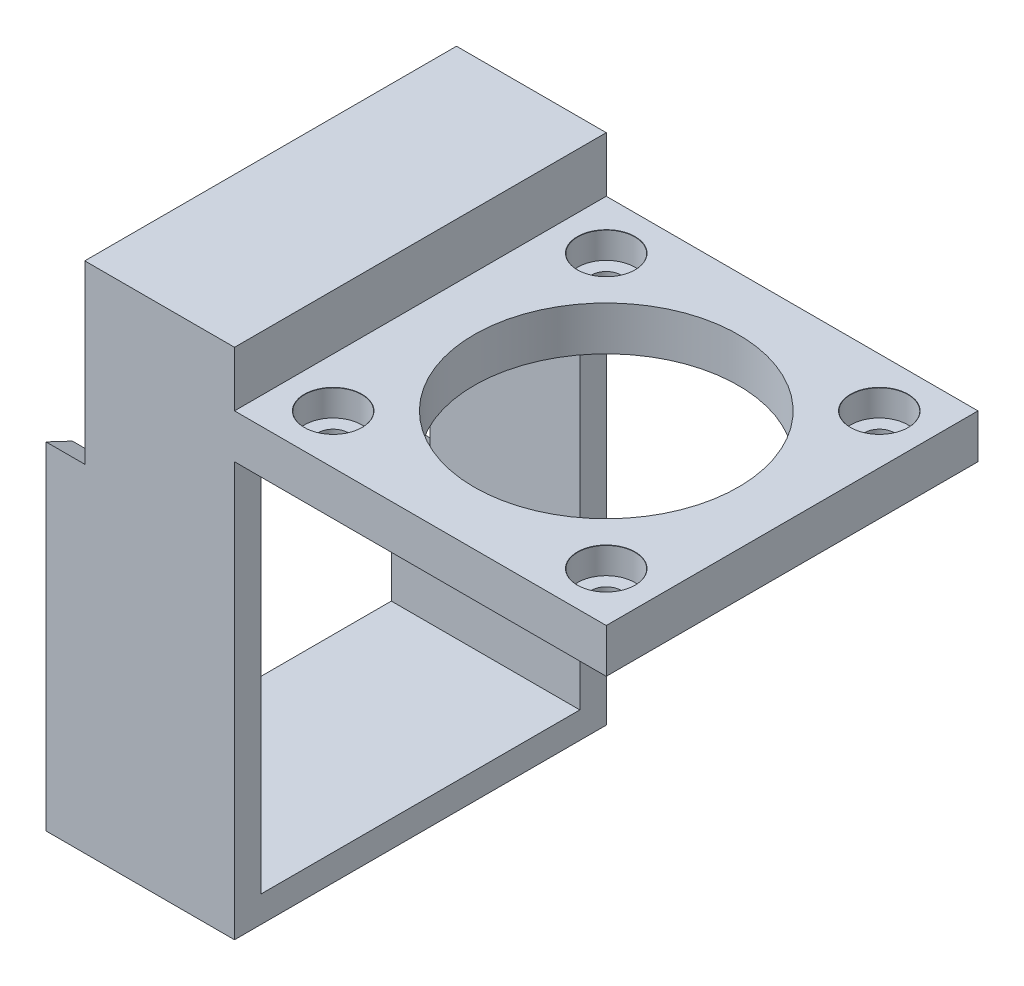
ISO-10303-21;
HEADER;
FILE_DESCRIPTION(('STEP AP214'),'2;1');
FILE_NAME('part.step','',(''),(''),'','','');
FILE_SCHEMA(('AUTOMOTIVE_DESIGN { 1 0 10303 214 1 1 1 1 }'));
ENDSEC;
DATA;
#1=APPLICATION_CONTEXT('core data for automotive mechanical design processes');
#2=APPLICATION_PROTOCOL_DEFINITION('international standard','automotive_design',2000,#1);
#3=PRODUCT_CONTEXT('',#1,'mechanical');
#4=PRODUCT('Part','Part','',(#3));
#5=PRODUCT_RELATED_PRODUCT_CATEGORY('part','',(#4));
#6=PRODUCT_DEFINITION_FORMATION('','',#4);
#7=PRODUCT_DEFINITION_CONTEXT('part definition',#1,'design');
#8=PRODUCT_DEFINITION('design','',#6,#7);
#9=PRODUCT_DEFINITION_SHAPE('','',#8);
#10=(LENGTH_UNIT() NAMED_UNIT(*) SI_UNIT(.MILLI.,.METRE.));
#11=(NAMED_UNIT(*) PLANE_ANGLE_UNIT() SI_UNIT($,.RADIAN.));
#12=(NAMED_UNIT(*) SI_UNIT($,.STERADIAN.) SOLID_ANGLE_UNIT());
#13=UNCERTAINTY_MEASURE_WITH_UNIT(LENGTH_MEASURE(1.E-05),#10,'distance_accuracy_value','');
#14=(GEOMETRIC_REPRESENTATION_CONTEXT(3) GLOBAL_UNCERTAINTY_ASSIGNED_CONTEXT((#13)) GLOBAL_UNIT_ASSIGNED_CONTEXT((#10,
#11,#12)) REPRESENTATION_CONTEXT('',''));
#15=CARTESIAN_POINT('',(0.,0.,0.));
#16=DIRECTION('',(0.,0.,1.));
#17=DIRECTION('',(1.,0.,0.));
#18=AXIS2_PLACEMENT_3D('',#15,#16,#17);
#19=CARTESIAN_POINT('',(-4.4,38.25,21.1));
#20=DIRECTION('',(0.,0.903650615755439,-0.428270434007317));
#21=DIRECTION('',(0.,0.428270434007317,0.903650615755439));
#22=AXIS2_PLACEMENT_3D('',#19,#20,#21);
#23=PLANE('',#22);
#24=DIRECTION('',(1.,0.,0.));
#25=VECTOR('',#24,1.);
#26=CARTESIAN_POINT('',(-4.4,36.8281990521327,18.1));
#27=LINE('',#26,#25);
#28=CARTESIAN_POINT('',(-4.4,36.8281990521327,18.1));
#29=VERTEX_POINT('',#28);
#30=CARTESIAN_POINT('',(0.,36.8281990521327,18.1));
#31=VERTEX_POINT('',#30);
#32=EDGE_CURVE('E450',#29,#31,#27,.T.);
#33=ORIENTED_EDGE('',*,*,#32,.F.);
#34=DIRECTION('',(0.,0.428270434007317,0.903650615755439));
#35=VECTOR('',#34,1.);
#36=CARTESIAN_POINT('',(-4.4,38.25,21.1));
#37=LINE('',#36,#35);
#38=CARTESIAN_POINT('',(-4.4,38.25,21.1));
#39=VERTEX_POINT('',#38);
#40=EDGE_CURVE('E176',#29,#39,#37,.T.);
#41=ORIENTED_EDGE('',*,*,#40,.T.);
#42=DIRECTION('',(1.,0.,0.));
#43=VECTOR('',#42,1.);
#44=CARTESIAN_POINT('',(-4.4,38.25,21.1));
#45=LINE('',#44,#43);
#46=CARTESIAN_POINT('',(0.,38.25,21.1));
#47=VERTEX_POINT('',#46);
#48=EDGE_CURVE('E201',#39,#47,#45,.T.);
#49=ORIENTED_EDGE('',*,*,#48,.T.);
#50=DIRECTION('',(0.,0.428270434007317,0.903650615755439));
#51=VECTOR('',#50,1.);
#52=CARTESIAN_POINT('',(0.,38.25,21.1));
#53=LINE('',#52,#51);
#54=EDGE_CURVE('E200',#31,#47,#53,.T.);
#55=ORIENTED_EDGE('',*,*,#54,.F.);
#56=EDGE_LOOP('',(#33,#41,#49,#55));
#57=FACE_BOUND('',#56,.T.);
#58=ADVANCED_FACE('F45',(#57),#23,.T.);
#59=CARTESIAN_POINT('',(17.,47.,-17.101));
#60=DIRECTION('',(1.,0.,0.));
#61=DIRECTION('',(0.,0.,-1.));
#62=AXIS2_PLACEMENT_3D('',#59,#60,#61);
#63=PLANE('',#62);
#64=DIRECTION('',(0.,0.,1.));
#65=VECTOR('',#64,1.);
#66=CARTESIAN_POINT('',(17.,52.,21.1));
#67=LINE('',#66,#65);
#68=CARTESIAN_POINT('',(17.,52.,-21.1));
#69=VERTEX_POINT('',#68);
#70=CARTESIAN_POINT('',(17.,52.,21.1));
#71=VERTEX_POINT('',#70);
#72=EDGE_CURVE('E297',#69,#71,#67,.T.);
#73=ORIENTED_EDGE('',*,*,#72,.F.);
#74=DIRECTION('',(0.,1.,0.));
#75=VECTOR('',#74,1.);
#76=CARTESIAN_POINT('',(17.,58.25,-21.1));
#77=LINE('',#76,#75);
#78=CARTESIAN_POINT('',(17.,58.25,-21.1));
#79=VERTEX_POINT('',#78);
#80=EDGE_CURVE('E337',#69,#79,#77,.T.);
#81=ORIENTED_EDGE('',*,*,#80,.T.);
#82=DIRECTION('',(0.,0.,1.));
#83=VECTOR('',#82,1.);
#84=CARTESIAN_POINT('',(17.,58.25,21.1));
#85=LINE('',#84,#83);
#86=CARTESIAN_POINT('',(17.,58.25,21.1));
#87=VERTEX_POINT('',#86);
#88=EDGE_CURVE('E324',#79,#87,#85,.T.);
#89=ORIENTED_EDGE('',*,*,#88,.T.);
#90=DIRECTION('',(0.,-1.,0.));
#91=VECTOR('',#90,1.);
#92=CARTESIAN_POINT('',(17.,58.25,21.1));
#93=LINE('',#92,#91);
#94=EDGE_CURVE('E342',#87,#71,#93,.T.);
#95=ORIENTED_EDGE('',*,*,#94,.T.);
#96=EDGE_LOOP('',(#73,#81,#89,#95));
#97=FACE_BOUND('',#96,.T.);
#98=ADVANCED_FACE('F394',(#97),#63,.T.);
#99=CARTESIAN_POINT('',(88.9298442928942,58.25,21.1));
#100=DIRECTION('',(0.,0.,-1.));
#101=DIRECTION('',(0.,1.,0.));
#102=AXIS2_PLACEMENT_3D('',#99,#100,#101);
#103=PLANE('',#102);
#104=ORIENTED_EDGE('',*,*,#94,.F.);
#105=DIRECTION('',(-1.,0.,0.));
#106=VECTOR('',#105,1.);
#107=CARTESIAN_POINT('',(88.9298442928942,58.25,21.1));
#108=LINE('',#107,#106);
#109=CARTESIAN_POINT('',(0.,58.25,21.1));
#110=VERTEX_POINT('',#109);
#111=EDGE_CURVE('E292',#87,#110,#108,.T.);
#112=ORIENTED_EDGE('',*,*,#111,.T.);
#113=DIRECTION('',(0.,-1.,0.));
#114=VECTOR('',#113,1.);
#115=CARTESIAN_POINT('',(0.,58.25,21.1));
#116=LINE('',#115,#114);
#117=EDGE_CURVE('E330',#110,#47,#116,.T.);
#118=ORIENTED_EDGE('',*,*,#117,.T.);
#119=ORIENTED_EDGE('',*,*,#48,.F.);
#120=DIRECTION('',(0.,-1.,0.));
#121=VECTOR('',#120,1.);
#122=CARTESIAN_POINT('',(-4.4,0.,21.1));
#123=LINE('',#122,#121);
#124=CARTESIAN_POINT('',(-4.4,0.,21.1));
#125=VERTEX_POINT('',#124);
#126=EDGE_CURVE('E179',#39,#125,#123,.T.);
#127=ORIENTED_EDGE('',*,*,#126,.T.);
#128=DIRECTION('',(-1.,0.,0.));
#129=VECTOR('',#128,1.);
#130=CARTESIAN_POINT('',(88.9298442928942,0.,21.1));
#131=LINE('',#130,#129);
#132=CARTESIAN_POINT('',(17.,0.,21.1));
#133=VERTEX_POINT('',#132);
#134=EDGE_CURVE('E334',#133,#125,#131,.T.);
#135=ORIENTED_EDGE('',*,*,#134,.F.);
#136=CARTESIAN_POINT('',(17.,47.,21.1));
#137=VERTEX_POINT('',#136);
#138=EDGE_CURVE('E345',#137,#133,#93,.T.);
#139=ORIENTED_EDGE('',*,*,#138,.F.);
#140=DIRECTION('',(-1.,0.,0.));
#141=VECTOR('',#140,1.);
#142=CARTESIAN_POINT('',(101.695176196834,47.,21.1));
#143=LINE('',#142,#141);
#144=CARTESIAN_POINT('',(59.2,47.,21.1));
#145=VERTEX_POINT('',#144);
#146=EDGE_CURVE('E313',#145,#137,#143,.T.);
#147=ORIENTED_EDGE('',*,*,#146,.F.);
#148=DIRECTION('',(0.,1.,0.));
#149=VECTOR('',#148,1.);
#150=CARTESIAN_POINT('',(59.2,52.,21.1));
#151=LINE('',#150,#149);
#152=CARTESIAN_POINT('',(59.2,52.,21.1));
#153=VERTEX_POINT('',#152);
#154=EDGE_CURVE('E288',#145,#153,#151,.T.);
#155=ORIENTED_EDGE('',*,*,#154,.T.);
#156=DIRECTION('',(-1.,0.,0.));
#157=VECTOR('',#156,1.);
#158=CARTESIAN_POINT('',(101.695176196834,52.,21.1));
#159=LINE('',#158,#157);
#160=EDGE_CURVE('E301',#153,#71,#159,.T.);
#161=ORIENTED_EDGE('',*,*,#160,.T.);
#162=EDGE_LOOP('',(#104,#112,#118,#119,#127,#135,#139,#147,#155,#161));
#163=FACE_BOUND('',#162,.T.);
#164=ADVANCED_FACE('F400',(#163),#103,.F.);
#165=CARTESIAN_POINT('',(88.9298442928942,0.,21.1));
#166=DIRECTION('',(0.,1.,0.));
#167=DIRECTION('',(0.,0.,1.));
#168=AXIS2_PLACEMENT_3D('',#165,#166,#167);
#169=PLANE('',#168);
#170=DIRECTION('',(0.,0.,-1.));
#171=VECTOR('',#170,1.);
#172=CARTESIAN_POINT('',(17.,0.,21.1));
#173=LINE('',#172,#171);
#174=CARTESIAN_POINT('',(17.,0.,-21.1));
#175=VERTEX_POINT('',#174);
#176=EDGE_CURVE('E338',#133,#175,#173,.T.);
#177=ORIENTED_EDGE('',*,*,#176,.F.);
#178=ORIENTED_EDGE('',*,*,#134,.T.);
#179=DIRECTION('',(0.,0.,-1.));
#180=VECTOR('',#179,1.);
#181=CARTESIAN_POINT('',(-4.4,0.,-21.1));
#182=LINE('',#181,#180);
#183=CARTESIAN_POINT('',(-4.4,0.,-21.1));
#184=VERTEX_POINT('',#183);
#185=EDGE_CURVE('E192',#125,#184,#182,.T.);
#186=ORIENTED_EDGE('',*,*,#185,.T.);
#187=DIRECTION('',(-1.,0.,0.));
#188=VECTOR('',#187,1.);
#189=CARTESIAN_POINT('',(88.9298442928942,0.,-21.1));
#190=LINE('',#189,#188);
#191=EDGE_CURVE('E329',#175,#184,#190,.T.);
#192=ORIENTED_EDGE('',*,*,#191,.F.);
#193=EDGE_LOOP('',(#177,#178,#186,#192));
#194=FACE_BOUND('',#193,.T.);
#195=ADVANCED_FACE('F465',(#194),#169,.F.);
#196=CARTESIAN_POINT('',(88.9298442928942,58.25,-21.1));
#197=DIRECTION('',(0.,0.,1.));
#198=DIRECTION('',(0.,-1.,0.));
#199=AXIS2_PLACEMENT_3D('',#196,#197,#198);
#200=PLANE('',#199);
#201=CARTESIAN_POINT('',(17.,47.,-21.1));
#202=VERTEX_POINT('',#201);
#203=EDGE_CURVE('E54',#175,#202,#77,.T.);
#204=ORIENTED_EDGE('',*,*,#203,.F.);
#205=ORIENTED_EDGE('',*,*,#191,.T.);
#206=DIRECTION('',(0.,1.,0.));
#207=VECTOR('',#206,1.);
#208=CARTESIAN_POINT('',(-4.4,18.25,-21.1));
#209=LINE('',#208,#207);
#210=CARTESIAN_POINT('',(-4.4,18.25,-21.1));
#211=VERTEX_POINT('',#210);
#212=EDGE_CURVE('E185',#184,#211,#209,.T.);
#213=ORIENTED_EDGE('',*,*,#212,.T.);
#214=DIRECTION('',(1.,0.,0.));
#215=VECTOR('',#214,1.);
#216=CARTESIAN_POINT('',(-4.4,18.25,-21.1));
#217=LINE('',#216,#215);
#218=CARTESIAN_POINT('',(0.,18.25,-21.1));
#219=VERTEX_POINT('',#218);
#220=EDGE_CURVE('E190',#211,#219,#217,.T.);
#221=ORIENTED_EDGE('',*,*,#220,.T.);
#222=DIRECTION('',(0.,1.,0.));
#223=VECTOR('',#222,1.);
#224=CARTESIAN_POINT('',(0.,58.25,-21.1));
#225=LINE('',#224,#223);
#226=CARTESIAN_POINT('',(0.,58.25,-21.1));
#227=VERTEX_POINT('',#226);
#228=EDGE_CURVE('E326',#219,#227,#225,.T.);
#229=ORIENTED_EDGE('',*,*,#228,.T.);
#230=DIRECTION('',(-1.,0.,0.));
#231=VECTOR('',#230,1.);
#232=CARTESIAN_POINT('',(88.9298442928942,58.25,-21.1));
#233=LINE('',#232,#231);
#234=EDGE_CURVE('E325',#79,#227,#233,.T.);
#235=ORIENTED_EDGE('',*,*,#234,.F.);
#236=ORIENTED_EDGE('',*,*,#80,.F.);
#237=DIRECTION('',(-1.,0.,0.));
#238=VECTOR('',#237,1.);
#239=CARTESIAN_POINT('',(101.695176196834,52.,-21.1));
#240=LINE('',#239,#238);
#241=CARTESIAN_POINT('',(59.2,52.,-21.1));
#242=VERTEX_POINT('',#241);
#243=EDGE_CURVE('E305',#242,#69,#240,.T.);
#244=ORIENTED_EDGE('',*,*,#243,.F.);
#245=DIRECTION('',(0.,-1.,0.));
#246=VECTOR('',#245,1.);
#247=CARTESIAN_POINT('',(59.2,52.,-21.1));
#248=LINE('',#247,#246);
#249=CARTESIAN_POINT('',(59.2,47.,-21.1));
#250=VERTEX_POINT('',#249);
#251=EDGE_CURVE('E279',#242,#250,#248,.T.);
#252=ORIENTED_EDGE('',*,*,#251,.T.);
#253=DIRECTION('',(-1.,0.,0.));
#254=VECTOR('',#253,1.);
#255=CARTESIAN_POINT('',(101.695176196834,47.,-21.1));
#256=LINE('',#255,#254);
#257=EDGE_CURVE('E309',#250,#202,#256,.T.);
#258=ORIENTED_EDGE('',*,*,#257,.T.);
#259=EDGE_LOOP('',(#204,#205,#213,#221,#229,#235,#236,#244,#252,#258));
#260=FACE_BOUND('',#259,.T.);
#261=ADVANCED_FACE('F485',(#260),#200,.F.);
#262=CARTESIAN_POINT('',(88.9298442928942,58.25,21.1));
#263=DIRECTION('',(0.,-1.,0.));
#264=DIRECTION('',(0.,0.,-1.));
#265=AXIS2_PLACEMENT_3D('',#262,#263,#264);
#266=PLANE('',#265);
#267=ORIENTED_EDGE('',*,*,#88,.F.);
#268=ORIENTED_EDGE('',*,*,#234,.T.);
#269=DIRECTION('',(0.,0.,1.));
#270=VECTOR('',#269,1.);
#271=CARTESIAN_POINT('',(0.,58.25,21.1));
#272=LINE('',#271,#270);
#273=EDGE_CURVE('E320',#227,#110,#272,.T.);
#274=ORIENTED_EDGE('',*,*,#273,.T.);
#275=ORIENTED_EDGE('',*,*,#111,.F.);
#276=EDGE_LOOP('',(#267,#268,#274,#275));
#277=FACE_BOUND('',#276,.T.);
#278=ADVANCED_FACE('F496',(#277),#266,.F.);
#279=CARTESIAN_POINT('',(0.,0.,0.));
#280=DIRECTION('',(1.,0.,0.));
#281=DIRECTION('',(0.,0.,-1.));
#282=AXIS2_PLACEMENT_3D('',#279,#280,#281);
#283=PLANE('',#282);
#284=DIRECTION('',(0.,0.,1.));
#285=VECTOR('',#284,1.);
#286=CARTESIAN_POINT('',(0.,44.25,0.));
#287=LINE('',#286,#285);
#288=CARTESIAN_POINT('',(0.,44.25,-18.1));
#289=VERTEX_POINT('',#288);
#290=CARTESIAN_POINT('',(0.,44.25,18.1));
#291=VERTEX_POINT('',#290);
#292=EDGE_CURVE('E424',#289,#291,#287,.T.);
#293=ORIENTED_EDGE('',*,*,#292,.T.);
#294=DIRECTION('',(0.,-1.,0.));
#295=VECTOR('',#294,1.);
#296=CARTESIAN_POINT('',(0.,0.,18.1));
#297=LINE('',#296,#295);
#298=EDGE_CURVE('E453',#291,#31,#297,.T.);
#299=ORIENTED_EDGE('',*,*,#298,.T.);
#300=ORIENTED_EDGE('',*,*,#54,.T.);
#301=ORIENTED_EDGE('',*,*,#117,.F.);
#302=ORIENTED_EDGE('',*,*,#273,.F.);
#303=ORIENTED_EDGE('',*,*,#228,.F.);
#304=CARTESIAN_POINT('',(0.,19.6718009478673,-18.1));
#305=VERTEX_POINT('',#304);
#306=EDGE_CURVE('E196',#219,#305,#53,.T.);
#307=ORIENTED_EDGE('',*,*,#306,.T.);
#308=DIRECTION('',(0.,1.,0.));
#309=VECTOR('',#308,1.);
#310=CARTESIAN_POINT('',(0.,0.,-18.1));
#311=LINE('',#310,#309);
#312=EDGE_CURVE('E447',#305,#289,#311,.T.);
#313=ORIENTED_EDGE('',*,*,#312,.T.);
#314=EDGE_LOOP('',(#293,#299,#300,#301,#302,#303,#307,#313));
#315=FACE_BOUND('',#314,.T.);
#316=ADVANCED_FACE('F513',(#315),#283,.F.);
#317=DIRECTION('',(0.,-1.,0.));
#318=VECTOR('',#317,1.);
#319=CARTESIAN_POINT('',(17.,44.25,18.1));
#320=LINE('',#319,#318);
#321=CARTESIAN_POINT('',(17.,44.25,18.1));
#322=VERTEX_POINT('',#321);
#323=CARTESIAN_POINT('',(17.,3.,18.1));
#324=VERTEX_POINT('',#323);
#325=EDGE_CURVE('E61',#322,#324,#320,.T.);
#326=ORIENTED_EDGE('',*,*,#325,.F.);
#327=DIRECTION('',(0.,0.,1.));
#328=VECTOR('',#327,1.);
#329=CARTESIAN_POINT('',(17.,44.25,18.1));
#330=LINE('',#329,#328);
#331=CARTESIAN_POINT('',(17.,44.25,-18.1));
#332=VERTEX_POINT('',#331);
#333=EDGE_CURVE('E171',#332,#322,#330,.T.);
#334=ORIENTED_EDGE('',*,*,#333,.F.);
#335=DIRECTION('',(0.,1.,0.));
#336=VECTOR('',#335,1.);
#337=CARTESIAN_POINT('',(17.,44.25,-18.1));
#338=LINE('',#337,#336);
#339=CARTESIAN_POINT('',(17.,3.,-18.1));
#340=VERTEX_POINT('',#339);
#341=EDGE_CURVE('E430',#340,#332,#338,.T.);
#342=ORIENTED_EDGE('',*,*,#341,.F.);
#343=DIRECTION('',(0.,0.,-1.));
#344=VECTOR('',#343,1.);
#345=CARTESIAN_POINT('',(17.,3.,18.1));
#346=LINE('',#345,#344);
#347=EDGE_CURVE('E433',#324,#340,#346,.T.);
#348=ORIENTED_EDGE('',*,*,#347,.F.);
#349=EDGE_LOOP('',(#326,#334,#342,#348));
#350=FACE_BOUND('',#349,.T.);
#351=DIRECTION('',(0.,0.,-1.));
#352=VECTOR('',#351,1.);
#353=CARTESIAN_POINT('',(17.,47.,21.1));
#354=LINE('',#353,#352);
#355=EDGE_CURVE('E293',#137,#202,#354,.T.);
#356=ORIENTED_EDGE('',*,*,#355,.F.);
#357=ORIENTED_EDGE('',*,*,#138,.T.);
#358=ORIENTED_EDGE('',*,*,#176,.T.);
#359=ORIENTED_EDGE('',*,*,#203,.T.);
#360=EDGE_LOOP('',(#356,#357,#358,#359));
#361=FACE_BOUND('',#360,.T.);
#362=ADVANCED_FACE('F47',(#350,#361),#63,.T.);
#363=CARTESIAN_POINT('',(101.695176196834,52.,21.1));
#364=DIRECTION('',(0.,-1.,0.));
#365=DIRECTION('',(0.,0.,-1.));
#366=AXIS2_PLACEMENT_3D('',#363,#364,#365);
#367=PLANE('',#366);
#368=CARTESIAN_POINT('',(38.1,52.,0.));
#369=DIRECTION('',(0.,1.,0.));
#370=DIRECTION('',(0.,0.,1.));
#371=AXIS2_PLACEMENT_3D('',#368,#369,#370);
#372=CIRCLE('',#371,15.);
#373=CARTESIAN_POINT('',(38.1,52.,15.));
#374=VERTEX_POINT('',#373);
#375=EDGE_CURVE('E204',#374,#374,#372,.T.);
#376=ORIENTED_EDGE('',*,*,#375,.F.);
#377=EDGE_LOOP('',(#376));
#378=FACE_BOUND('',#377,.T.);
#379=CARTESIAN_POINT('',(53.6,52.,15.5));
#380=DIRECTION('',(0.,1.,0.));
#381=DIRECTION('',(0.,0.,1.));
#382=AXIS2_PLACEMENT_3D('',#379,#380,#381);
#383=CIRCLE('',#382,3.275);
#384=CARTESIAN_POINT('',(53.6,52.,18.775));
#385=VERTEX_POINT('',#384);
#386=EDGE_CURVE('E211',#385,#385,#383,.T.);
#387=ORIENTED_EDGE('',*,*,#386,.F.);
#388=EDGE_LOOP('',(#387));
#389=FACE_BOUND('',#388,.T.);
#390=CARTESIAN_POINT('',(53.6,52.,-15.5));
#391=DIRECTION('',(0.,1.,0.));
#392=DIRECTION('',(0.,0.,1.));
#393=AXIS2_PLACEMENT_3D('',#390,#391,#392);
#394=CIRCLE('',#393,3.275);
#395=CARTESIAN_POINT('',(53.6,52.,-12.225));
#396=VERTEX_POINT('',#395);
#397=EDGE_CURVE('E228',#396,#396,#394,.T.);
#398=ORIENTED_EDGE('',*,*,#397,.F.);
#399=EDGE_LOOP('',(#398));
#400=FACE_BOUND('',#399,.T.);
#401=CARTESIAN_POINT('',(22.6,52.,-15.5));
#402=DIRECTION('',(0.,1.,0.));
#403=DIRECTION('',(0.,0.,1.));
#404=AXIS2_PLACEMENT_3D('',#401,#402,#403);
#405=CIRCLE('',#404,3.275);
#406=CARTESIAN_POINT('',(22.6,52.,-12.225));
#407=VERTEX_POINT('',#406);
#408=EDGE_CURVE('E245',#407,#407,#405,.T.);
#409=ORIENTED_EDGE('',*,*,#408,.F.);
#410=EDGE_LOOP('',(#409));
#411=FACE_BOUND('',#410,.T.);
#412=CARTESIAN_POINT('',(22.6,52.,15.5));
#413=DIRECTION('',(0.,1.,0.));
#414=DIRECTION('',(0.,0.,1.));
#415=AXIS2_PLACEMENT_3D('',#412,#413,#414);
#416=CIRCLE('',#415,3.275);
#417=CARTESIAN_POINT('',(22.6,52.,18.775));
#418=VERTEX_POINT('',#417);
#419=EDGE_CURVE('E262',#418,#418,#416,.T.);
#420=ORIENTED_EDGE('',*,*,#419,.F.);
#421=EDGE_LOOP('',(#420));
#422=FACE_BOUND('',#421,.T.);
#423=ORIENTED_EDGE('',*,*,#160,.F.);
#424=DIRECTION('',(0.,0.,-1.));
#425=VECTOR('',#424,1.);
#426=CARTESIAN_POINT('',(59.2,52.,21.1));
#427=LINE('',#426,#425);
#428=EDGE_CURVE('E284',#153,#242,#427,.T.);
#429=ORIENTED_EDGE('',*,*,#428,.T.);
#430=ORIENTED_EDGE('',*,*,#243,.T.);
#431=ORIENTED_EDGE('',*,*,#72,.T.);
#432=EDGE_LOOP('',(#423,#429,#430,#431));
#433=FACE_BOUND('',#432,.T.);
#434=ADVANCED_FACE('F499',(#378,#389,#400,#411,#422,#433),#367,.F.);
#435=CARTESIAN_POINT('',(101.695176196834,47.,21.1));
#436=DIRECTION('',(0.,1.,0.));
#437=DIRECTION('',(0.,0.,1.));
#438=AXIS2_PLACEMENT_3D('',#435,#436,#437);
#439=PLANE('',#438);
#440=CARTESIAN_POINT('',(38.1,47.,0.));
#441=DIRECTION('',(0.,1.,0.));
#442=DIRECTION('',(0.,0.,1.));
#443=AXIS2_PLACEMENT_3D('',#440,#441,#442);
#444=CIRCLE('',#443,15.);
#445=CARTESIAN_POINT('',(38.1,47.,15.));
#446=VERTEX_POINT('',#445);
#447=EDGE_CURVE('E210',#446,#446,#444,.T.);
#448=ORIENTED_EDGE('',*,*,#447,.T.);
#449=EDGE_LOOP('',(#448));
#450=FACE_BOUND('',#449,.T.);
#451=CARTESIAN_POINT('',(53.6,47.,15.5));
#452=DIRECTION('',(0.,1.,0.));
#453=DIRECTION('',(0.,0.,1.));
#454=AXIS2_PLACEMENT_3D('',#451,#452,#453);
#455=CIRCLE('',#454,1.69999999999999);
#456=CARTESIAN_POINT('',(53.6,47.,17.2));
#457=VERTEX_POINT('',#456);
#458=EDGE_CURVE('E227',#457,#457,#455,.T.);
#459=ORIENTED_EDGE('',*,*,#458,.T.);
#460=EDGE_LOOP('',(#459));
#461=FACE_BOUND('',#460,.T.);
#462=CARTESIAN_POINT('',(53.6,47.,-15.5));
#463=DIRECTION('',(0.,1.,0.));
#464=DIRECTION('',(0.,0.,1.));
#465=AXIS2_PLACEMENT_3D('',#462,#463,#464);
#466=CIRCLE('',#465,1.69999999999999);
#467=CARTESIAN_POINT('',(53.6,47.,-13.8));
#468=VERTEX_POINT('',#467);
#469=EDGE_CURVE('E244',#468,#468,#466,.T.);
#470=ORIENTED_EDGE('',*,*,#469,.T.);
#471=EDGE_LOOP('',(#470));
#472=FACE_BOUND('',#471,.T.);
#473=CARTESIAN_POINT('',(22.6,47.,-15.5));
#474=DIRECTION('',(0.,1.,0.));
#475=DIRECTION('',(0.,0.,1.));
#476=AXIS2_PLACEMENT_3D('',#473,#474,#475);
#477=CIRCLE('',#476,1.69999999999999);
#478=CARTESIAN_POINT('',(22.6,47.,-13.8));
#479=VERTEX_POINT('',#478);
#480=EDGE_CURVE('E261',#479,#479,#477,.T.);
#481=ORIENTED_EDGE('',*,*,#480,.T.);
#482=EDGE_LOOP('',(#481));
#483=FACE_BOUND('',#482,.T.);
#484=CARTESIAN_POINT('',(22.6,47.,15.5));
#485=DIRECTION('',(0.,1.,0.));
#486=DIRECTION('',(0.,0.,1.));
#487=AXIS2_PLACEMENT_3D('',#484,#485,#486);
#488=CIRCLE('',#487,1.69999999999999);
#489=CARTESIAN_POINT('',(22.6,47.,17.2));
#490=VERTEX_POINT('',#489);
#491=EDGE_CURVE('E278',#490,#490,#488,.T.);
#492=ORIENTED_EDGE('',*,*,#491,.T.);
#493=EDGE_LOOP('',(#492));
#494=FACE_BOUND('',#493,.T.);
#495=ORIENTED_EDGE('',*,*,#257,.F.);
#496=DIRECTION('',(0.,0.,1.));
#497=VECTOR('',#496,1.);
#498=CARTESIAN_POINT('',(59.2,47.,21.1));
#499=LINE('',#498,#497);
#500=EDGE_CURVE('E283',#250,#145,#499,.T.);
#501=ORIENTED_EDGE('',*,*,#500,.T.);
#502=ORIENTED_EDGE('',*,*,#146,.T.);
#503=ORIENTED_EDGE('',*,*,#355,.T.);
#504=EDGE_LOOP('',(#495,#501,#502,#503));
#505=FACE_BOUND('',#504,.T.);
#506=ADVANCED_FACE('F373',(#450,#461,#472,#483,#494,#505),#439,.F.);
#507=CARTESIAN_POINT('',(59.2,47.,-17.101));
#508=DIRECTION('',(-1.,0.,0.));
#509=DIRECTION('',(0.,0.,1.));
#510=AXIS2_PLACEMENT_3D('',#507,#508,#509);
#511=PLANE('',#510);
#512=ORIENTED_EDGE('',*,*,#500,.F.);
#513=ORIENTED_EDGE('',*,*,#251,.F.);
#514=ORIENTED_EDGE('',*,*,#428,.F.);
#515=ORIENTED_EDGE('',*,*,#154,.F.);
#516=EDGE_LOOP('',(#512,#513,#514,#515));
#517=FACE_BOUND('',#516,.T.);
#518=ADVANCED_FACE('F501',(#517),#511,.F.);
#519=CARTESIAN_POINT('',(22.6,52.,15.5));
#520=DIRECTION('',(0.,1.,0.));
#521=DIRECTION('',(0.,0.,1.));
#522=AXIS2_PLACEMENT_3D('',#519,#520,#521);
#523=CYLINDRICAL_SURFACE('',#522,1.69999999999999);
#524=CARTESIAN_POINT('',(22.6,49.,15.5));
#525=DIRECTION('',(0.,1.,0.));
#526=DIRECTION('',(0.,0.,1.));
#527=AXIS2_PLACEMENT_3D('',#524,#525,#526);
#528=CIRCLE('',#527,1.7);
#529=CARTESIAN_POINT('',(22.6,49.,17.2));
#530=VERTEX_POINT('',#529);
#531=EDGE_CURVE('E274',#530,#530,#528,.T.);
#532=ORIENTED_EDGE('',*,*,#531,.T.);
#533=EDGE_LOOP('',(#532));
#534=FACE_BOUND('',#533,.T.);
#535=ORIENTED_EDGE('',*,*,#491,.F.);
#536=EDGE_LOOP('',(#535));
#537=FACE_BOUND('',#536,.T.);
#538=ADVANCED_FACE('F508',(#534,#537),#523,.F.);
#539=CARTESIAN_POINT('',(25.85,49.,15.5));
#540=DIRECTION('',(0.,-1.,0.));
#541=DIRECTION('',(0.,0.,-1.));
#542=AXIS2_PLACEMENT_3D('',#539,#540,#541);
#543=PLANE('',#542);
#544=ORIENTED_EDGE('',*,*,#531,.F.);
#545=EDGE_LOOP('',(#544));
#546=FACE_BOUND('',#545,.T.);
#547=CARTESIAN_POINT('',(22.6,49.,15.5));
#548=DIRECTION('',(0.,1.,0.));
#549=DIRECTION('',(0.,0.,1.));
#550=AXIS2_PLACEMENT_3D('',#547,#548,#549);
#551=CIRCLE('',#550,3.25);
#552=CARTESIAN_POINT('',(22.6,49.,18.75));
#553=VERTEX_POINT('',#552);
#554=EDGE_CURVE('E270',#553,#553,#551,.T.);
#555=ORIENTED_EDGE('',*,*,#554,.T.);
#556=EDGE_LOOP('',(#555));
#557=FACE_BOUND('',#556,.T.);
#558=ADVANCED_FACE('F635',(#546,#557),#543,.F.);
#559=CARTESIAN_POINT('',(22.6,52.,15.5));
#560=DIRECTION('',(0.,1.,0.));
#561=DIRECTION('',(0.,0.,1.));
#562=AXIS2_PLACEMENT_3D('',#559,#560,#561);
#563=CYLINDRICAL_SURFACE('',#562,3.25);
#564=ORIENTED_EDGE('',*,*,#554,.F.);
#565=EDGE_LOOP('',(#564));
#566=FACE_BOUND('',#565,.T.);
#567=CARTESIAN_POINT('',(22.6,51.975,15.5));
#568=DIRECTION('',(0.,1.,0.));
#569=DIRECTION('',(0.,0.,1.));
#570=AXIS2_PLACEMENT_3D('',#567,#568,#569);
#571=CIRCLE('',#570,3.25);
#572=CARTESIAN_POINT('',(22.6,51.975,18.75));
#573=VERTEX_POINT('',#572);
#574=EDGE_CURVE('E266',#573,#573,#571,.T.);
#575=ORIENTED_EDGE('',*,*,#574,.T.);
#576=EDGE_LOOP('',(#575));
#577=FACE_BOUND('',#576,.T.);
#578=ADVANCED_FACE('F644',(#566,#577),#563,.F.);
#579=CARTESIAN_POINT('',(22.6,52.,15.5));
#580=DIRECTION('',(0.,1.,0.));
#581=DIRECTION('',(0.,0.,1.));
#582=AXIS2_PLACEMENT_3D('',#579,#580,#581);
#583=CONICAL_SURFACE('',#582,3.275,0.785398163397379);
#584=ORIENTED_EDGE('',*,*,#574,.F.);
#585=EDGE_LOOP('',(#584));
#586=FACE_BOUND('',#585,.T.);
#587=ORIENTED_EDGE('',*,*,#419,.T.);
#588=EDGE_LOOP('',(#587));
#589=FACE_BOUND('',#588,.T.);
#590=ADVANCED_FACE('F653',(#586,#589),#583,.F.);
#591=CARTESIAN_POINT('',(22.6,52.,-15.5));
#592=DIRECTION('',(0.,1.,0.));
#593=DIRECTION('',(0.,0.,1.));
#594=AXIS2_PLACEMENT_3D('',#591,#592,#593);
#595=CYLINDRICAL_SURFACE('',#594,1.69999999999999);
#596=CARTESIAN_POINT('',(22.6,49.,-15.5));
#597=DIRECTION('',(0.,1.,0.));
#598=DIRECTION('',(0.,0.,1.));
#599=AXIS2_PLACEMENT_3D('',#596,#597,#598);
#600=CIRCLE('',#599,1.7);
#601=CARTESIAN_POINT('',(22.6,49.,-13.8));
#602=VERTEX_POINT('',#601);
#603=EDGE_CURVE('E257',#602,#602,#600,.T.);
#604=ORIENTED_EDGE('',*,*,#603,.T.);
#605=EDGE_LOOP('',(#604));
#606=FACE_BOUND('',#605,.T.);
#607=ORIENTED_EDGE('',*,*,#480,.F.);
#608=EDGE_LOOP('',(#607));
#609=FACE_BOUND('',#608,.T.);
#610=ADVANCED_FACE('F662',(#606,#609),#595,.F.);
#611=CARTESIAN_POINT('',(25.85,49.,-15.5));
#612=DIRECTION('',(0.,-1.,0.));
#613=DIRECTION('',(0.,0.,-1.));
#614=AXIS2_PLACEMENT_3D('',#611,#612,#613);
#615=PLANE('',#614);
#616=ORIENTED_EDGE('',*,*,#603,.F.);
#617=EDGE_LOOP('',(#616));
#618=FACE_BOUND('',#617,.T.);
#619=CARTESIAN_POINT('',(22.6,49.,-15.5));
#620=DIRECTION('',(0.,1.,0.));
#621=DIRECTION('',(0.,0.,1.));
#622=AXIS2_PLACEMENT_3D('',#619,#620,#621);
#623=CIRCLE('',#622,3.25);
#624=CARTESIAN_POINT('',(22.6,49.,-12.25));
#625=VERTEX_POINT('',#624);
#626=EDGE_CURVE('E253',#625,#625,#623,.T.);
#627=ORIENTED_EDGE('',*,*,#626,.T.);
#628=EDGE_LOOP('',(#627));
#629=FACE_BOUND('',#628,.T.);
#630=ADVANCED_FACE('F671',(#618,#629),#615,.F.);
#631=CARTESIAN_POINT('',(22.6,52.,-15.5));
#632=DIRECTION('',(0.,1.,0.));
#633=DIRECTION('',(0.,0.,1.));
#634=AXIS2_PLACEMENT_3D('',#631,#632,#633);
#635=CYLINDRICAL_SURFACE('',#634,3.25);
#636=ORIENTED_EDGE('',*,*,#626,.F.);
#637=EDGE_LOOP('',(#636));
#638=FACE_BOUND('',#637,.T.);
#639=CARTESIAN_POINT('',(22.6,51.975,-15.5));
#640=DIRECTION('',(0.,1.,0.));
#641=DIRECTION('',(0.,0.,1.));
#642=AXIS2_PLACEMENT_3D('',#639,#640,#641);
#643=CIRCLE('',#642,3.25);
#644=CARTESIAN_POINT('',(22.6,51.975,-12.25));
#645=VERTEX_POINT('',#644);
#646=EDGE_CURVE('E249',#645,#645,#643,.T.);
#647=ORIENTED_EDGE('',*,*,#646,.T.);
#648=EDGE_LOOP('',(#647));
#649=FACE_BOUND('',#648,.T.);
#650=ADVANCED_FACE('F680',(#638,#649),#635,.F.);
#651=CARTESIAN_POINT('',(22.6,52.,-15.5));
#652=DIRECTION('',(0.,1.,0.));
#653=DIRECTION('',(0.,0.,1.));
#654=AXIS2_PLACEMENT_3D('',#651,#652,#653);
#655=CONICAL_SURFACE('',#654,3.275,0.785398163397379);
#656=ORIENTED_EDGE('',*,*,#646,.F.);
#657=EDGE_LOOP('',(#656));
#658=FACE_BOUND('',#657,.T.);
#659=ORIENTED_EDGE('',*,*,#408,.T.);
#660=EDGE_LOOP('',(#659));
#661=FACE_BOUND('',#660,.T.);
#662=ADVANCED_FACE('F689',(#658,#661),#655,.F.);
#663=CARTESIAN_POINT('',(53.6,52.,-15.5));
#664=DIRECTION('',(0.,1.,0.));
#665=DIRECTION('',(0.,0.,1.));
#666=AXIS2_PLACEMENT_3D('',#663,#664,#665);
#667=CYLINDRICAL_SURFACE('',#666,1.69999999999999);
#668=CARTESIAN_POINT('',(53.6,49.,-15.5));
#669=DIRECTION('',(0.,1.,0.));
#670=DIRECTION('',(0.,0.,1.));
#671=AXIS2_PLACEMENT_3D('',#668,#669,#670);
#672=CIRCLE('',#671,1.7);
#673=CARTESIAN_POINT('',(53.6,49.,-13.8));
#674=VERTEX_POINT('',#673);
#675=EDGE_CURVE('E240',#674,#674,#672,.T.);
#676=ORIENTED_EDGE('',*,*,#675,.T.);
#677=EDGE_LOOP('',(#676));
#678=FACE_BOUND('',#677,.T.);
#679=ORIENTED_EDGE('',*,*,#469,.F.);
#680=EDGE_LOOP('',(#679));
#681=FACE_BOUND('',#680,.T.);
#682=ADVANCED_FACE('F698',(#678,#681),#667,.F.);
#683=CARTESIAN_POINT('',(56.85,49.,-15.5));
#684=DIRECTION('',(0.,-1.,0.));
#685=DIRECTION('',(0.,0.,-1.));
#686=AXIS2_PLACEMENT_3D('',#683,#684,#685);
#687=PLANE('',#686);
#688=ORIENTED_EDGE('',*,*,#675,.F.);
#689=EDGE_LOOP('',(#688));
#690=FACE_BOUND('',#689,.T.);
#691=CARTESIAN_POINT('',(53.6,49.,-15.5));
#692=DIRECTION('',(0.,1.,0.));
#693=DIRECTION('',(0.,0.,1.));
#694=AXIS2_PLACEMENT_3D('',#691,#692,#693);
#695=CIRCLE('',#694,3.25);
#696=CARTESIAN_POINT('',(53.6,49.,-12.25));
#697=VERTEX_POINT('',#696);
#698=EDGE_CURVE('E236',#697,#697,#695,.T.);
#699=ORIENTED_EDGE('',*,*,#698,.T.);
#700=EDGE_LOOP('',(#699));
#701=FACE_BOUND('',#700,.T.);
#702=ADVANCED_FACE('F707',(#690,#701),#687,.F.);
#703=CARTESIAN_POINT('',(53.6,52.,-15.5));
#704=DIRECTION('',(0.,1.,0.));
#705=DIRECTION('',(0.,0.,1.));
#706=AXIS2_PLACEMENT_3D('',#703,#704,#705);
#707=CYLINDRICAL_SURFACE('',#706,3.25);
#708=ORIENTED_EDGE('',*,*,#698,.F.);
#709=EDGE_LOOP('',(#708));
#710=FACE_BOUND('',#709,.T.);
#711=CARTESIAN_POINT('',(53.6,51.975,-15.5));
#712=DIRECTION('',(0.,1.,0.));
#713=DIRECTION('',(0.,0.,1.));
#714=AXIS2_PLACEMENT_3D('',#711,#712,#713);
#715=CIRCLE('',#714,3.25);
#716=CARTESIAN_POINT('',(53.6,51.975,-12.25));
#717=VERTEX_POINT('',#716);
#718=EDGE_CURVE('E232',#717,#717,#715,.T.);
#719=ORIENTED_EDGE('',*,*,#718,.T.);
#720=EDGE_LOOP('',(#719));
#721=FACE_BOUND('',#720,.T.);
#722=ADVANCED_FACE('F716',(#710,#721),#707,.F.);
#723=CARTESIAN_POINT('',(53.6,52.,-15.5));
#724=DIRECTION('',(0.,1.,0.));
#725=DIRECTION('',(0.,0.,1.));
#726=AXIS2_PLACEMENT_3D('',#723,#724,#725);
#727=CONICAL_SURFACE('',#726,3.275,0.785398163397448);
#728=ORIENTED_EDGE('',*,*,#718,.F.);
#729=EDGE_LOOP('',(#728));
#730=FACE_BOUND('',#729,.T.);
#731=ORIENTED_EDGE('',*,*,#397,.T.);
#732=EDGE_LOOP('',(#731));
#733=FACE_BOUND('',#732,.T.);
#734=ADVANCED_FACE('F725',(#730,#733),#727,.F.);
#735=CARTESIAN_POINT('',(53.6,52.,15.5));
#736=DIRECTION('',(0.,1.,0.));
#737=DIRECTION('',(0.,0.,1.));
#738=AXIS2_PLACEMENT_3D('',#735,#736,#737);
#739=CYLINDRICAL_SURFACE('',#738,1.69999999999999);
#740=CARTESIAN_POINT('',(53.6,49.,15.5));
#741=DIRECTION('',(0.,1.,0.));
#742=DIRECTION('',(0.,0.,1.));
#743=AXIS2_PLACEMENT_3D('',#740,#741,#742);
#744=CIRCLE('',#743,1.7);
#745=CARTESIAN_POINT('',(53.6,49.,17.2));
#746=VERTEX_POINT('',#745);
#747=EDGE_CURVE('E223',#746,#746,#744,.T.);
#748=ORIENTED_EDGE('',*,*,#747,.T.);
#749=EDGE_LOOP('',(#748));
#750=FACE_BOUND('',#749,.T.);
#751=ORIENTED_EDGE('',*,*,#458,.F.);
#752=EDGE_LOOP('',(#751));
#753=FACE_BOUND('',#752,.T.);
#754=ADVANCED_FACE('F734',(#750,#753),#739,.F.);
#755=CARTESIAN_POINT('',(56.85,49.,15.5));
#756=DIRECTION('',(0.,-1.,0.));
#757=DIRECTION('',(0.,0.,-1.));
#758=AXIS2_PLACEMENT_3D('',#755,#756,#757);
#759=PLANE('',#758);
#760=ORIENTED_EDGE('',*,*,#747,.F.);
#761=EDGE_LOOP('',(#760));
#762=FACE_BOUND('',#761,.T.);
#763=CARTESIAN_POINT('',(53.6,49.,15.5));
#764=DIRECTION('',(0.,1.,0.));
#765=DIRECTION('',(0.,0.,1.));
#766=AXIS2_PLACEMENT_3D('',#763,#764,#765);
#767=CIRCLE('',#766,3.25);
#768=CARTESIAN_POINT('',(53.6,49.,18.75));
#769=VERTEX_POINT('',#768);
#770=EDGE_CURVE('E219',#769,#769,#767,.T.);
#771=ORIENTED_EDGE('',*,*,#770,.T.);
#772=EDGE_LOOP('',(#771));
#773=FACE_BOUND('',#772,.T.);
#774=ADVANCED_FACE('F743',(#762,#773),#759,.F.);
#775=CARTESIAN_POINT('',(53.6,52.,15.5));
#776=DIRECTION('',(0.,1.,0.));
#777=DIRECTION('',(0.,0.,1.));
#778=AXIS2_PLACEMENT_3D('',#775,#776,#777);
#779=CYLINDRICAL_SURFACE('',#778,3.25);
#780=ORIENTED_EDGE('',*,*,#770,.F.);
#781=EDGE_LOOP('',(#780));
#782=FACE_BOUND('',#781,.T.);
#783=CARTESIAN_POINT('',(53.6,51.975,15.5));
#784=DIRECTION('',(0.,1.,0.));
#785=DIRECTION('',(0.,0.,1.));
#786=AXIS2_PLACEMENT_3D('',#783,#784,#785);
#787=CIRCLE('',#786,3.25);
#788=CARTESIAN_POINT('',(53.6,51.975,18.75));
#789=VERTEX_POINT('',#788);
#790=EDGE_CURVE('E215',#789,#789,#787,.T.);
#791=ORIENTED_EDGE('',*,*,#790,.T.);
#792=EDGE_LOOP('',(#791));
#793=FACE_BOUND('',#792,.T.);
#794=ADVANCED_FACE('F390',(#782,#793),#779,.F.);
#795=CARTESIAN_POINT('',(53.6,52.,15.5));
#796=DIRECTION('',(0.,1.,0.));
#797=DIRECTION('',(0.,0.,1.));
#798=AXIS2_PLACEMENT_3D('',#795,#796,#797);
#799=CONICAL_SURFACE('',#798,3.275,0.785398163397309);
#800=ORIENTED_EDGE('',*,*,#790,.F.);
#801=EDGE_LOOP('',(#800));
#802=FACE_BOUND('',#801,.T.);
#803=ORIENTED_EDGE('',*,*,#386,.T.);
#804=EDGE_LOOP('',(#803));
#805=FACE_BOUND('',#804,.T.);
#806=ADVANCED_FACE('F379',(#802,#805),#799,.F.);
#807=CARTESIAN_POINT('',(38.1,0.,0.));
#808=DIRECTION('',(0.,1.,0.));
#809=DIRECTION('',(0.,0.,1.));
#810=AXIS2_PLACEMENT_3D('',#807,#808,#809);
#811=CYLINDRICAL_SURFACE('',#810,15.);
#812=ORIENTED_EDGE('',*,*,#375,.T.);
#813=EDGE_LOOP('',(#812));
#814=FACE_BOUND('',#813,.T.);
#815=ORIENTED_EDGE('',*,*,#447,.F.);
#816=EDGE_LOOP('',(#815));
#817=FACE_BOUND('',#816,.T.);
#818=ADVANCED_FACE('F376',(#814,#817),#811,.F.);
#819=DIRECTION('',(-1.,0.,0.));
#820=VECTOR('',#819,1.);
#821=CARTESIAN_POINT('',(-4.40000000000001,19.6718009478673,-18.1));
#822=LINE('',#821,#820);
#823=CARTESIAN_POINT('',(-4.4,19.6718009478673,-18.1));
#824=VERTEX_POINT('',#823);
#825=EDGE_CURVE('E441',#305,#824,#822,.T.);
#826=ORIENTED_EDGE('',*,*,#825,.F.);
#827=ORIENTED_EDGE('',*,*,#306,.F.);
#828=ORIENTED_EDGE('',*,*,#220,.F.);
#829=EDGE_CURVE('E184',#211,#824,#37,.T.);
#830=ORIENTED_EDGE('',*,*,#829,.T.);
#831=EDGE_LOOP('',(#826,#827,#828,#830));
#832=FACE_BOUND('',#831,.T.);
#833=ADVANCED_FACE('F378',(#832),#23,.T.);
#834=CARTESIAN_POINT('',(-4.4,0.,0.));
#835=DIRECTION('',(1.,0.,0.));
#836=DIRECTION('',(0.,0.,-1.));
#837=AXIS2_PLACEMENT_3D('',#834,#835,#836);
#838=PLANE('',#837);
#839=ORIENTED_EDGE('',*,*,#40,.F.);
#840=DIRECTION('',(0.,-1.,0.));
#841=VECTOR('',#840,1.);
#842=CARTESIAN_POINT('',(-4.4,0.,18.1));
#843=LINE('',#842,#841);
#844=CARTESIAN_POINT('',(-4.4,3.,18.1));
#845=VERTEX_POINT('',#844);
#846=EDGE_CURVE('E11',#29,#845,#843,.T.);
#847=ORIENTED_EDGE('',*,*,#846,.T.);
#848=DIRECTION('',(0.,0.,-1.));
#849=VECTOR('',#848,1.);
#850=CARTESIAN_POINT('',(-4.4,3.,18.1));
#851=LINE('',#850,#849);
#852=CARTESIAN_POINT('',(-4.4,3.,-18.1));
#853=VERTEX_POINT('',#852);
#854=EDGE_CURVE('E167',#845,#853,#851,.T.);
#855=ORIENTED_EDGE('',*,*,#854,.T.);
#856=DIRECTION('',(0.,1.,0.));
#857=VECTOR('',#856,1.);
#858=CARTESIAN_POINT('',(-4.4,44.25,-18.1));
#859=LINE('',#858,#857);
#860=EDGE_CURVE('E69',#853,#824,#859,.T.);
#861=ORIENTED_EDGE('',*,*,#860,.T.);
#862=ORIENTED_EDGE('',*,*,#829,.F.);
#863=ORIENTED_EDGE('',*,*,#212,.F.);
#864=ORIENTED_EDGE('',*,*,#185,.F.);
#865=ORIENTED_EDGE('',*,*,#126,.F.);
#866=EDGE_LOOP('',(#839,#847,#855,#861,#862,#863,#864,#865));
#867=FACE_BOUND('',#866,.T.);
#868=ADVANCED_FACE('F174',(#867),#838,.F.);
#869=CARTESIAN_POINT('',(-4.4,44.25,18.1));
#870=DIRECTION('',(0.,1.,0.));
#871=DIRECTION('',(0.,0.,1.));
#872=AXIS2_PLACEMENT_3D('',#869,#870,#871);
#873=PLANE('',#872);
#874=DIRECTION('',(1.,0.,0.));
#875=VECTOR('',#874,1.);
#876=CARTESIAN_POINT('',(-4.4,44.25,-18.1));
#877=LINE('',#876,#875);
#878=EDGE_CURVE('E419',#289,#332,#877,.T.);
#879=ORIENTED_EDGE('',*,*,#878,.T.);
#880=ORIENTED_EDGE('',*,*,#333,.T.);
#881=DIRECTION('',(1.,0.,0.));
#882=VECTOR('',#881,1.);
#883=CARTESIAN_POINT('',(-4.4,44.25,18.1));
#884=LINE('',#883,#882);
#885=EDGE_CURVE('E427',#291,#322,#884,.T.);
#886=ORIENTED_EDGE('',*,*,#885,.F.);
#887=ORIENTED_EDGE('',*,*,#292,.F.);
#888=EDGE_LOOP('',(#879,#880,#886,#887));
#889=FACE_BOUND('',#888,.T.);
#890=ADVANCED_FACE('F405',(#889),#873,.F.);
#891=CARTESIAN_POINT('',(-4.4,44.25,18.1));
#892=DIRECTION('',(0.,0.,1.));
#893=DIRECTION('',(0.,-1.,0.));
#894=AXIS2_PLACEMENT_3D('',#891,#892,#893);
#895=PLANE('',#894);
#896=ORIENTED_EDGE('',*,*,#885,.T.);
#897=ORIENTED_EDGE('',*,*,#325,.T.);
#898=DIRECTION('',(1.,0.,0.));
#899=VECTOR('',#898,1.);
#900=CARTESIAN_POINT('',(-4.4,3.,18.1));
#901=LINE('',#900,#899);
#902=EDGE_CURVE('E156',#845,#324,#901,.T.);
#903=ORIENTED_EDGE('',*,*,#902,.F.);
#904=ORIENTED_EDGE('',*,*,#846,.F.);
#905=ORIENTED_EDGE('',*,*,#32,.T.);
#906=ORIENTED_EDGE('',*,*,#298,.F.);
#907=EDGE_LOOP('',(#896,#897,#903,#904,#905,#906));
#908=FACE_BOUND('',#907,.T.);
#909=ADVANCED_FACE('F158',(#908),#895,.F.);
#910=CARTESIAN_POINT('',(-4.4,44.25,-18.1));
#911=DIRECTION('',(0.,0.,-1.));
#912=DIRECTION('',(0.,1.,0.));
#913=AXIS2_PLACEMENT_3D('',#910,#911,#912);
#914=PLANE('',#913);
#915=ORIENTED_EDGE('',*,*,#825,.T.);
#916=ORIENTED_EDGE('',*,*,#860,.F.);
#917=DIRECTION('',(1.,0.,0.));
#918=VECTOR('',#917,1.);
#919=CARTESIAN_POINT('',(-4.4,3.,-18.1));
#920=LINE('',#919,#918);
#921=EDGE_CURVE('E164',#853,#340,#920,.T.);
#922=ORIENTED_EDGE('',*,*,#921,.T.);
#923=ORIENTED_EDGE('',*,*,#341,.T.);
#924=ORIENTED_EDGE('',*,*,#878,.F.);
#925=ORIENTED_EDGE('',*,*,#312,.F.);
#926=EDGE_LOOP('',(#915,#916,#922,#923,#924,#925));
#927=FACE_BOUND('',#926,.T.);
#928=ADVANCED_FACE('F408',(#927),#914,.F.);
#929=CARTESIAN_POINT('',(-4.4,3.,18.1));
#930=DIRECTION('',(0.,-1.,0.));
#931=DIRECTION('',(0.,0.,-1.));
#932=AXIS2_PLACEMENT_3D('',#929,#930,#931);
#933=PLANE('',#932);
#934=ORIENTED_EDGE('',*,*,#347,.T.);
#935=ORIENTED_EDGE('',*,*,#921,.F.);
#936=ORIENTED_EDGE('',*,*,#854,.F.);
#937=ORIENTED_EDGE('',*,*,#902,.T.);
#938=EDGE_LOOP('',(#934,#935,#936,#937));
#939=FACE_BOUND('',#938,.T.);
#940=ADVANCED_FACE('F168',(#939),#933,.F.);
#941=CLOSED_SHELL('',(#58,#98,#164,#195,#261,#278,#316,#362,#434,#506,#518,#538,#558,#578,#590,
#610,#630,#650,#662,#682,#702,#722,#734,#754,#774,#794,#806,#818,#833,#868,#890,#909,#928,#940));
#942=MANIFOLD_SOLID_BREP('B2',#941);
#943=ADVANCED_BREP_SHAPE_REPRESENTATION('',(#18,#942),#14);
#944=SHAPE_DEFINITION_REPRESENTATION(#9,#943);
ENDSEC;
END-ISO-10303-21;
